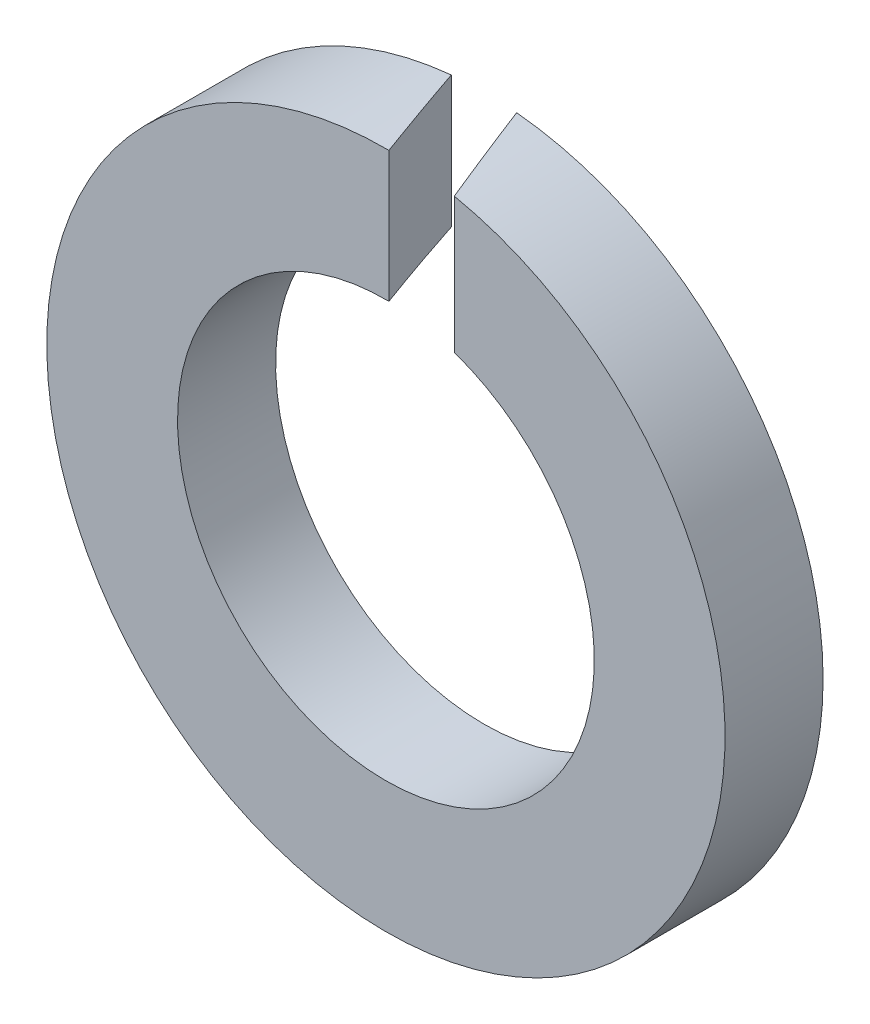
ISO-10303-21;
HEADER;
FILE_DESCRIPTION(('STEP AP214'),'2;1');
FILE_NAME('part.step','',(''),(''),'','','');
FILE_SCHEMA(('AUTOMOTIVE_DESIGN { 1 0 10303 214 1 1 1 1 }'));
ENDSEC;
DATA;
#1=APPLICATION_CONTEXT('core data for automotive mechanical design processes');
#2=APPLICATION_PROTOCOL_DEFINITION('international standard','automotive_design',2000,#1);
#3=PRODUCT_CONTEXT('',#1,'mechanical');
#4=PRODUCT('Part','Part','',(#3));
#5=PRODUCT_RELATED_PRODUCT_CATEGORY('part','',(#4));
#6=PRODUCT_DEFINITION_FORMATION('','',#4);
#7=PRODUCT_DEFINITION_CONTEXT('part definition',#1,'design');
#8=PRODUCT_DEFINITION('design','',#6,#7);
#9=PRODUCT_DEFINITION_SHAPE('','',#8);
#10=(LENGTH_UNIT() NAMED_UNIT(*) SI_UNIT(.MILLI.,.METRE.));
#11=(NAMED_UNIT(*) PLANE_ANGLE_UNIT() SI_UNIT($,.RADIAN.));
#12=(NAMED_UNIT(*) SI_UNIT($,.STERADIAN.) SOLID_ANGLE_UNIT());
#13=UNCERTAINTY_MEASURE_WITH_UNIT(LENGTH_MEASURE(1.E-05),#10,'distance_accuracy_value','');
#14=(GEOMETRIC_REPRESENTATION_CONTEXT(3) GLOBAL_UNCERTAINTY_ASSIGNED_CONTEXT((#13)) GLOBAL_UNIT_ASSIGNED_CONTEXT((#10,
#11,#12)) REPRESENTATION_CONTEXT('',''));
#15=CARTESIAN_POINT('',(0.,0.,0.));
#16=DIRECTION('',(0.,0.,1.));
#17=DIRECTION('',(1.,0.,0.));
#18=AXIS2_PLACEMENT_3D('',#15,#16,#17);
#19=CARTESIAN_POINT('',(0.,0.,1.2));
#20=DIRECTION('',(0.,0.,1.));
#21=DIRECTION('',(1.,0.,0.));
#22=AXIS2_PLACEMENT_3D('',#19,#20,#21);
#23=PLANE('',#22);
#24=CARTESIAN_POINT('',(0.,0.,1.2));
#25=DIRECTION('',(0.,0.,1.));
#26=DIRECTION('',(1.,0.,0.));
#27=AXIS2_PLACEMENT_3D('',#24,#25,#26);
#28=CIRCLE('',#27,4.15);
#29=CARTESIAN_POINT('',(0.036764281119422,4.14983715194148,1.2));
#30=VERTEX_POINT('',#29);
#31=CARTESIAN_POINT('',(0.836764281119425,4.06476635710377,1.2));
#32=VERTEX_POINT('',#31);
#33=EDGE_CURVE('E77',#30,#32,#28,.T.);
#34=ORIENTED_EDGE('',*,*,#33,.T.);
#35=DIRECTION('',(0.,-1.,0.));
#36=VECTOR('',#35,1.);
#37=CARTESIAN_POINT('',(0.836764281119425,0.,1.2));
#38=LINE('',#37,#36);
#39=CARTESIAN_POINT('',(0.836764281119425,2.40880168088672,1.2));
#40=VERTEX_POINT('',#39);
#41=EDGE_CURVE('E91',#32,#40,#38,.T.);
#42=ORIENTED_EDGE('',*,*,#41,.T.);
#43=CARTESIAN_POINT('',(0.,0.,1.2));
#44=DIRECTION('',(0.,0.,1.));
#45=DIRECTION('',(1.,0.,0.));
#46=AXIS2_PLACEMENT_3D('',#43,#44,#45);
#47=CIRCLE('',#46,2.55);
#48=CARTESIAN_POINT('',(0.036764281119422,2.54973496419408,1.2));
#49=VERTEX_POINT('',#48);
#50=EDGE_CURVE('E87',#49,#40,#47,.T.);
#51=ORIENTED_EDGE('',*,*,#50,.F.);
#52=DIRECTION('',(0.,1.,0.));
#53=VECTOR('',#52,1.);
#54=CARTESIAN_POINT('',(0.036764281119422,0.,1.2));
#55=LINE('',#54,#53);
#56=EDGE_CURVE('E54',#49,#30,#55,.T.);
#57=ORIENTED_EDGE('',*,*,#56,.T.);
#58=EDGE_LOOP('',(#34,#42,#51,#57));
#59=FACE_BOUND('',#58,.T.);
#60=ADVANCED_FACE('F32',(#59),#23,.T.);
#61=CARTESIAN_POINT('',(0.,0.,0.));
#62=DIRECTION('',(0.,0.,1.));
#63=DIRECTION('',(1.,0.,0.));
#64=AXIS2_PLACEMENT_3D('',#61,#62,#63);
#65=PLANE('',#64);
#66=DIRECTION('',(0.,-1.,0.));
#67=VECTOR('',#66,1.);
#68=CARTESIAN_POINT('',(0.399999999999976,0.,0.));
#69=LINE('',#68,#67);
#70=CARTESIAN_POINT('',(0.399999999999976,4.13067791046458,0.));
#71=VERTEX_POINT('',#70);
#72=CARTESIAN_POINT('',(0.399999999999976,2.51843205189261,0.));
#73=VERTEX_POINT('',#72);
#74=EDGE_CURVE('E47',#71,#73,#69,.T.);
#75=ORIENTED_EDGE('',*,*,#74,.F.);
#76=CARTESIAN_POINT('',(0.,0.,0.));
#77=DIRECTION('',(0.,0.,1.));
#78=DIRECTION('',(1.,0.,0.));
#79=AXIS2_PLACEMENT_3D('',#76,#77,#78);
#80=CIRCLE('',#79,4.15);
#81=CARTESIAN_POINT('',(-0.400000000000027,4.13067791046457,0.));
#82=VERTEX_POINT('',#81);
#83=EDGE_CURVE('E84',#82,#71,#80,.T.);
#84=ORIENTED_EDGE('',*,*,#83,.F.);
#85=DIRECTION('',(0.,1.,0.));
#86=VECTOR('',#85,1.);
#87=CARTESIAN_POINT('',(-0.400000000000027,0.,0.));
#88=LINE('',#87,#86);
#89=CARTESIAN_POINT('',(-0.400000000000027,2.5184320518926,0.));
#90=VERTEX_POINT('',#89);
#91=EDGE_CURVE('E71',#90,#82,#88,.T.);
#92=ORIENTED_EDGE('',*,*,#91,.F.);
#93=CARTESIAN_POINT('',(0.,0.,0.));
#94=DIRECTION('',(0.,0.,1.));
#95=DIRECTION('',(1.,0.,0.));
#96=AXIS2_PLACEMENT_3D('',#93,#94,#95);
#97=CIRCLE('',#96,2.55);
#98=EDGE_CURVE('E82',#90,#73,#97,.T.);
#99=ORIENTED_EDGE('',*,*,#98,.T.);
#100=EDGE_LOOP('',(#75,#84,#92,#99));
#101=FACE_BOUND('',#100,.T.);
#102=ADVANCED_FACE('F81',(#101),#65,.F.);
#103=CARTESIAN_POINT('',(0.,0.,1.2));
#104=DIRECTION('',(0.,0.,-1.));
#105=DIRECTION('',(-1.,0.,0.));
#106=AXIS2_PLACEMENT_3D('',#103,#104,#105);
#107=CYLINDRICAL_SURFACE('',#106,4.15);
#108=CARTESIAN_POINT('',(0.,0.,-1.09899096778177));
#109=DIRECTION('',(-0.939692620785907,0.,0.342020143325673));
#110=DIRECTION('',(-0.342020143325673,0.,-0.939692620785907));
#111=AXIS2_PLACEMENT_3D('',#108,#109,#110);
#112=ELLIPSE('',#111,12.1337882606767,4.15);
#113=EDGE_CURVE('E88',#32,#71,#112,.T.);
#114=ORIENTED_EDGE('',*,*,#113,.F.);
#115=ORIENTED_EDGE('',*,*,#33,.F.);
#116=CARTESIAN_POINT('',(0.,0.,1.09899096778191));
#117=DIRECTION('',(0.939692620785907,0.,-0.342020143325673));
#118=DIRECTION('',(-0.342020143325673,0.,-0.939692620785907));
#119=AXIS2_PLACEMENT_3D('',#116,#117,#118);
#120=ELLIPSE('',#119,12.1337882606767,4.15);
#121=EDGE_CURVE('E99',#82,#30,#120,.T.);
#122=ORIENTED_EDGE('',*,*,#121,.F.);
#123=ORIENTED_EDGE('',*,*,#83,.T.);
#124=EDGE_LOOP('',(#114,#115,#122,#123));
#125=FACE_BOUND('',#124,.T.);
#126=ADVANCED_FACE('F34',(#125),#107,.T.);
#127=CARTESIAN_POINT('',(0.,0.,1.2));
#128=DIRECTION('',(0.,0.,-1.));
#129=DIRECTION('',(-1.,0.,0.));
#130=AXIS2_PLACEMENT_3D('',#127,#128,#129);
#131=CYLINDRICAL_SURFACE('',#130,2.55);
#132=ORIENTED_EDGE('',*,*,#50,.T.);
#133=CARTESIAN_POINT('',(0.,0.,-1.09899096778177));
#134=DIRECTION('',(-0.939692620785907,0.,0.342020143325673));
#135=DIRECTION('',(-0.342020143325673,0.,-0.939692620785907));
#136=AXIS2_PLACEMENT_3D('',#133,#134,#135);
#137=ELLIPSE('',#136,7.45570122041578,2.55);
#138=EDGE_CURVE('E11',#40,#73,#137,.T.);
#139=ORIENTED_EDGE('',*,*,#138,.T.);
#140=ORIENTED_EDGE('',*,*,#98,.F.);
#141=CARTESIAN_POINT('',(0.,0.,1.09899096778191));
#142=DIRECTION('',(0.939692620785907,0.,-0.342020143325673));
#143=DIRECTION('',(-0.342020143325673,0.,-0.939692620785907));
#144=AXIS2_PLACEMENT_3D('',#141,#142,#143);
#145=ELLIPSE('',#144,7.45570122041578,2.55);
#146=EDGE_CURVE('E40',#90,#49,#145,.T.);
#147=ORIENTED_EDGE('',*,*,#146,.T.);
#148=EDGE_LOOP('',(#132,#139,#140,#147));
#149=FACE_BOUND('',#148,.T.);
#150=ADVANCED_FACE('F86',(#149),#131,.F.);
#151=CARTESIAN_POINT('',(0.772221758200914,4.15,3.22065281125044));
#152=DIRECTION('',(0.939692620785907,0.,-0.342020143325673));
#153=DIRECTION('',(-0.342020143325673,0.,-0.939692620785907));
#154=AXIS2_PLACEMENT_3D('',#151,#152,#153);
#155=PLANE('',#154);
#156=ORIENTED_EDGE('',*,*,#121,.T.);
#157=ORIENTED_EDGE('',*,*,#56,.F.);
#158=ORIENTED_EDGE('',*,*,#146,.F.);
#159=ORIENTED_EDGE('',*,*,#91,.T.);
#160=EDGE_LOOP('',(#156,#157,#158,#159));
#161=FACE_BOUND('',#160,.T.);
#162=ADVANCED_FACE('F70',(#161),#155,.T.);
#163=CARTESIAN_POINT('',(1.48383310567363,4.15,2.97780698429571));
#164=DIRECTION('',(-0.939692620785907,0.,0.342020143325673));
#165=DIRECTION('',(0.342020143325673,0.,0.939692620785907));
#166=AXIS2_PLACEMENT_3D('',#163,#164,#165);
#167=PLANE('',#166);
#168=ORIENTED_EDGE('',*,*,#113,.T.);
#169=ORIENTED_EDGE('',*,*,#74,.T.);
#170=ORIENTED_EDGE('',*,*,#138,.F.);
#171=ORIENTED_EDGE('',*,*,#41,.F.);
#172=EDGE_LOOP('',(#168,#169,#170,#171));
#173=FACE_BOUND('',#172,.T.);
#174=ADVANCED_FACE('F106',(#173),#167,.T.);
#175=CLOSED_SHELL('',(#60,#102,#126,#150,#162,#174));
#176=MANIFOLD_SOLID_BREP('B2',#175);
#177=ADVANCED_BREP_SHAPE_REPRESENTATION('',(#18,#176),#14);
#178=SHAPE_DEFINITION_REPRESENTATION(#9,#177);
ENDSEC;
END-ISO-10303-21;
